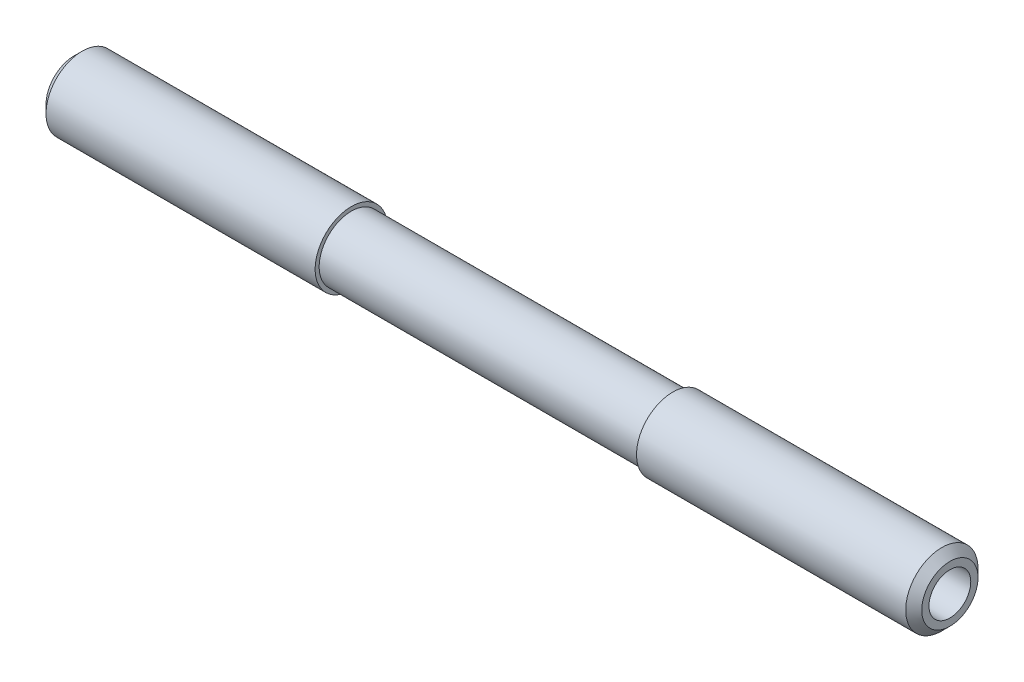
ISO-10303-21;
HEADER;
FILE_DESCRIPTION(('STEP AP214'),'2;1');
FILE_NAME('part.step','',(''),(''),'','','');
FILE_SCHEMA(('AUTOMOTIVE_DESIGN { 1 0 10303 214 1 1 1 1 }'));
ENDSEC;
DATA;
#1=APPLICATION_CONTEXT('core data for automotive mechanical design processes');
#2=APPLICATION_PROTOCOL_DEFINITION('international standard','automotive_design',2000,#1);
#3=PRODUCT_CONTEXT('',#1,'mechanical');
#4=PRODUCT('Part','Part','',(#3));
#5=PRODUCT_RELATED_PRODUCT_CATEGORY('part','',(#4));
#6=PRODUCT_DEFINITION_FORMATION('','',#4);
#7=PRODUCT_DEFINITION_CONTEXT('part definition',#1,'design');
#8=PRODUCT_DEFINITION('design','',#6,#7);
#9=PRODUCT_DEFINITION_SHAPE('','',#8);
#10=(LENGTH_UNIT() NAMED_UNIT(*) SI_UNIT(.MILLI.,.METRE.));
#11=(NAMED_UNIT(*) PLANE_ANGLE_UNIT() SI_UNIT($,.RADIAN.));
#12=(NAMED_UNIT(*) SI_UNIT($,.STERADIAN.) SOLID_ANGLE_UNIT());
#13=UNCERTAINTY_MEASURE_WITH_UNIT(LENGTH_MEASURE(1.E-05),#10,'distance_accuracy_value','');
#14=(GEOMETRIC_REPRESENTATION_CONTEXT(3) GLOBAL_UNCERTAINTY_ASSIGNED_CONTEXT((#13)) GLOBAL_UNIT_ASSIGNED_CONTEXT((#10,
#11,#12)) REPRESENTATION_CONTEXT('',''));
#15=CARTESIAN_POINT('',(0.,0.,0.));
#16=DIRECTION('',(0.,0.,1.));
#17=DIRECTION('',(1.,0.,0.));
#18=AXIS2_PLACEMENT_3D('',#15,#16,#17);
#19=CARTESIAN_POINT('',(54.5,0.,0.));
#20=DIRECTION('',(-1.,0.,0.));
#21=DIRECTION('',(0.,0.,1.));
#22=AXIS2_PLACEMENT_3D('',#19,#20,#21);
#23=CYLINDRICAL_SURFACE('',#22,4.5);
#24=CARTESIAN_POINT('',(-53.5,0.,0.));
#25=DIRECTION('',(1.,0.,0.));
#26=DIRECTION('',(0.,0.,-1.));
#27=AXIS2_PLACEMENT_3D('',#24,#25,#26);
#28=CIRCLE('',#27,4.5);
#29=CARTESIAN_POINT('',(-53.5,0.,-4.5));
#30=VERTEX_POINT('',#29);
#31=EDGE_CURVE('E40',#30,#30,#28,.T.);
#32=ORIENTED_EDGE('',*,*,#31,.T.);
#33=EDGE_LOOP('',(#32));
#34=FACE_BOUND('',#33,.T.);
#35=CARTESIAN_POINT('',(-20.,0.,0.));
#36=DIRECTION('',(1.,0.,0.));
#37=DIRECTION('',(0.,0.,-1.));
#38=AXIS2_PLACEMENT_3D('',#35,#36,#37);
#39=CIRCLE('',#38,4.5);
#40=CARTESIAN_POINT('',(-20.,0.,-4.5));
#41=VERTEX_POINT('',#40);
#42=EDGE_CURVE('E46',#41,#41,#39,.T.);
#43=ORIENTED_EDGE('',*,*,#42,.F.);
#44=EDGE_LOOP('',(#43));
#45=FACE_BOUND('',#44,.T.);
#46=ADVANCED_FACE('F25',(#34,#45),#23,.T.);
#47=CARTESIAN_POINT('',(54.5,0.,0.));
#48=DIRECTION('',(1.,0.,0.));
#49=DIRECTION('',(0.,0.,-1.));
#50=AXIS2_PLACEMENT_3D('',#47,#48,#49);
#51=PLANE('',#50);
#52=CARTESIAN_POINT('',(54.5,0.,0.));
#53=DIRECTION('',(1.,0.,0.));
#54=DIRECTION('',(0.,0.,-1.));
#55=AXIS2_PLACEMENT_3D('',#52,#53,#54);
#56=CIRCLE('',#55,3.5);
#57=CARTESIAN_POINT('',(54.5,0.,-3.5));
#58=VERTEX_POINT('',#57);
#59=EDGE_CURVE('E32',#58,#58,#56,.T.);
#60=ORIENTED_EDGE('',*,*,#59,.T.);
#61=EDGE_LOOP('',(#60));
#62=FACE_BOUND('',#61,.T.);
#63=CARTESIAN_POINT('',(54.5,0.,0.));
#64=DIRECTION('',(1.,0.,0.));
#65=DIRECTION('',(0.,0.,-1.));
#66=AXIS2_PLACEMENT_3D('',#63,#64,#65);
#67=CIRCLE('',#66,2.6);
#68=CARTESIAN_POINT('',(54.5,0.,-2.6));
#69=VERTEX_POINT('',#68);
#70=EDGE_CURVE('E45',#69,#69,#67,.T.);
#71=ORIENTED_EDGE('',*,*,#70,.F.);
#72=EDGE_LOOP('',(#71));
#73=FACE_BOUND('',#72,.T.);
#74=ADVANCED_FACE('F82',(#62,#73),#51,.T.);
#75=CARTESIAN_POINT('',(-54.5,0.,0.));
#76=DIRECTION('',(1.,0.,0.));
#77=DIRECTION('',(0.,0.,-1.));
#78=AXIS2_PLACEMENT_3D('',#75,#76,#77);
#79=PLANE('',#78);
#80=CARTESIAN_POINT('',(-54.5,0.,0.));
#81=DIRECTION('',(1.,0.,0.));
#82=DIRECTION('',(0.,0.,-1.));
#83=AXIS2_PLACEMENT_3D('',#80,#81,#82);
#84=CIRCLE('',#83,3.49999999999999);
#85=CARTESIAN_POINT('',(-54.5,0.,-3.49999999999999));
#86=VERTEX_POINT('',#85);
#87=EDGE_CURVE('E36',#86,#86,#84,.F.);
#88=ORIENTED_EDGE('',*,*,#87,.T.);
#89=EDGE_LOOP('',(#88));
#90=FACE_BOUND('',#89,.T.);
#91=CARTESIAN_POINT('',(-54.5,0.,0.));
#92=DIRECTION('',(1.,0.,0.));
#93=DIRECTION('',(0.,0.,-1.));
#94=AXIS2_PLACEMENT_3D('',#91,#92,#93);
#95=CIRCLE('',#94,2.6);
#96=CARTESIAN_POINT('',(-54.5,0.,-2.6));
#97=VERTEX_POINT('',#96);
#98=EDGE_CURVE('E49',#97,#97,#95,.T.);
#99=ORIENTED_EDGE('',*,*,#98,.T.);
#100=EDGE_LOOP('',(#99));
#101=FACE_BOUND('',#100,.T.);
#102=ADVANCED_FACE('F89',(#90,#101),#79,.F.);
#103=CARTESIAN_POINT('',(53.5,0.,0.));
#104=DIRECTION('',(1.,0.,0.));
#105=DIRECTION('',(0.,0.,-1.));
#106=AXIS2_PLACEMENT_3D('',#103,#104,#105);
#107=CIRCLE('',#106,4.5);
#108=CARTESIAN_POINT('',(53.5,0.,-4.5));
#109=VERTEX_POINT('',#108);
#110=EDGE_CURVE('E11',#109,#109,#107,.F.);
#111=ORIENTED_EDGE('',*,*,#110,.T.);
#112=EDGE_LOOP('',(#111));
#113=FACE_BOUND('',#112,.T.);
#114=CARTESIAN_POINT('',(20.,0.,0.));
#115=DIRECTION('',(1.,0.,0.));
#116=DIRECTION('',(0.,0.,-1.));
#117=AXIS2_PLACEMENT_3D('',#114,#115,#116);
#118=CIRCLE('',#117,4.5);
#119=CARTESIAN_POINT('',(20.,0.,-4.5));
#120=VERTEX_POINT('',#119);
#121=EDGE_CURVE('E50',#120,#120,#118,.T.);
#122=ORIENTED_EDGE('',*,*,#121,.T.);
#123=EDGE_LOOP('',(#122));
#124=FACE_BOUND('',#123,.T.);
#125=ADVANCED_FACE('F27',(#113,#124),#23,.T.);
#126=CARTESIAN_POINT('',(54.5,0.,0.));
#127=DIRECTION('',(-1.,0.,0.));
#128=DIRECTION('',(0.,0.,1.));
#129=AXIS2_PLACEMENT_3D('',#126,#127,#128);
#130=CYLINDRICAL_SURFACE('',#129,2.6);
#131=ORIENTED_EDGE('',*,*,#70,.T.);
#132=EDGE_LOOP('',(#131));
#133=FACE_BOUND('',#132,.T.);
#134=ORIENTED_EDGE('',*,*,#98,.F.);
#135=EDGE_LOOP('',(#134));
#136=FACE_BOUND('',#135,.T.);
#137=ADVANCED_FACE('F92',(#133,#136),#130,.F.);
#138=CARTESIAN_POINT('',(-20.,0.,0.));
#139=DIRECTION('',(1.,0.,0.));
#140=DIRECTION('',(0.,0.,-1.));
#141=AXIS2_PLACEMENT_3D('',#138,#139,#140);
#142=PLANE('',#141);
#143=CARTESIAN_POINT('',(-20.,0.,0.));
#144=DIRECTION('',(1.,0.,0.));
#145=DIRECTION('',(0.,0.,-1.));
#146=AXIS2_PLACEMENT_3D('',#143,#144,#145);
#147=CIRCLE('',#146,4.);
#148=CARTESIAN_POINT('',(-20.,0.,-4.));
#149=VERTEX_POINT('',#148);
#150=EDGE_CURVE('E53',#149,#149,#147,.T.);
#151=ORIENTED_EDGE('',*,*,#150,.F.);
#152=EDGE_LOOP('',(#151));
#153=FACE_BOUND('',#152,.T.);
#154=ORIENTED_EDGE('',*,*,#42,.T.);
#155=EDGE_LOOP('',(#154));
#156=FACE_BOUND('',#155,.T.);
#157=ADVANCED_FACE('F79',(#153,#156),#142,.T.);
#158=CARTESIAN_POINT('',(20.,0.,0.));
#159=DIRECTION('',(1.,0.,0.));
#160=DIRECTION('',(0.,0.,-1.));
#161=AXIS2_PLACEMENT_3D('',#158,#159,#160);
#162=PLANE('',#161);
#163=CARTESIAN_POINT('',(20.,0.,0.));
#164=DIRECTION('',(1.,0.,0.));
#165=DIRECTION('',(0.,0.,-1.));
#166=AXIS2_PLACEMENT_3D('',#163,#164,#165);
#167=CIRCLE('',#166,4.);
#168=CARTESIAN_POINT('',(20.,0.,-4.));
#169=VERTEX_POINT('',#168);
#170=EDGE_CURVE('E60',#169,#169,#167,.T.);
#171=ORIENTED_EDGE('',*,*,#170,.T.);
#172=EDGE_LOOP('',(#171));
#173=FACE_BOUND('',#172,.T.);
#174=ORIENTED_EDGE('',*,*,#121,.F.);
#175=EDGE_LOOP('',(#174));
#176=FACE_BOUND('',#175,.T.);
#177=ADVANCED_FACE('F64',(#173,#176),#162,.F.);
#178=CARTESIAN_POINT('',(-20.,0.,0.));
#179=DIRECTION('',(1.,0.,0.));
#180=DIRECTION('',(0.,0.,-1.));
#181=AXIS2_PLACEMENT_3D('',#178,#179,#180);
#182=CYLINDRICAL_SURFACE('',#181,4.);
#183=ORIENTED_EDGE('',*,*,#150,.T.);
#184=EDGE_LOOP('',(#183));
#185=FACE_BOUND('',#184,.T.);
#186=ORIENTED_EDGE('',*,*,#170,.F.);
#187=EDGE_LOOP('',(#186));
#188=FACE_BOUND('',#187,.T.);
#189=ADVANCED_FACE('F67',(#185,#188),#182,.T.);
#190=CARTESIAN_POINT('',(-53.5,0.,0.));
#191=DIRECTION('',(1.,0.,0.));
#192=DIRECTION('',(0.,0.,-1.));
#193=AXIS2_PLACEMENT_3D('',#190,#191,#192);
#194=CONICAL_SURFACE('',#193,4.5,0.78539816339746);
#195=ORIENTED_EDGE('',*,*,#87,.F.);
#196=EDGE_LOOP('',(#195));
#197=FACE_BOUND('',#196,.T.);
#198=ORIENTED_EDGE('',*,*,#31,.F.);
#199=EDGE_LOOP('',(#198));
#200=FACE_BOUND('',#199,.T.);
#201=ADVANCED_FACE('F69',(#197,#200),#194,.T.);
#202=CARTESIAN_POINT('',(54.5,0.,0.));
#203=DIRECTION('',(-1.,0.,0.));
#204=DIRECTION('',(0.,0.,1.));
#205=AXIS2_PLACEMENT_3D('',#202,#203,#204);
#206=CONICAL_SURFACE('',#205,3.5,0.785398163397449);
#207=ORIENTED_EDGE('',*,*,#110,.F.);
#208=EDGE_LOOP('',(#207));
#209=FACE_BOUND('',#208,.T.);
#210=ORIENTED_EDGE('',*,*,#59,.F.);
#211=EDGE_LOOP('',(#210));
#212=FACE_BOUND('',#211,.T.);
#213=ADVANCED_FACE('F76',(#209,#212),#206,.T.);
#214=CLOSED_SHELL('',(#46,#74,#102,#125,#137,#157,#177,#189,#201,#213));
#215=MANIFOLD_SOLID_BREP('B2',#214);
#216=ADVANCED_BREP_SHAPE_REPRESENTATION('',(#18,#215),#14);
#217=SHAPE_DEFINITION_REPRESENTATION(#9,#216);
ENDSEC;
END-ISO-10303-21;
